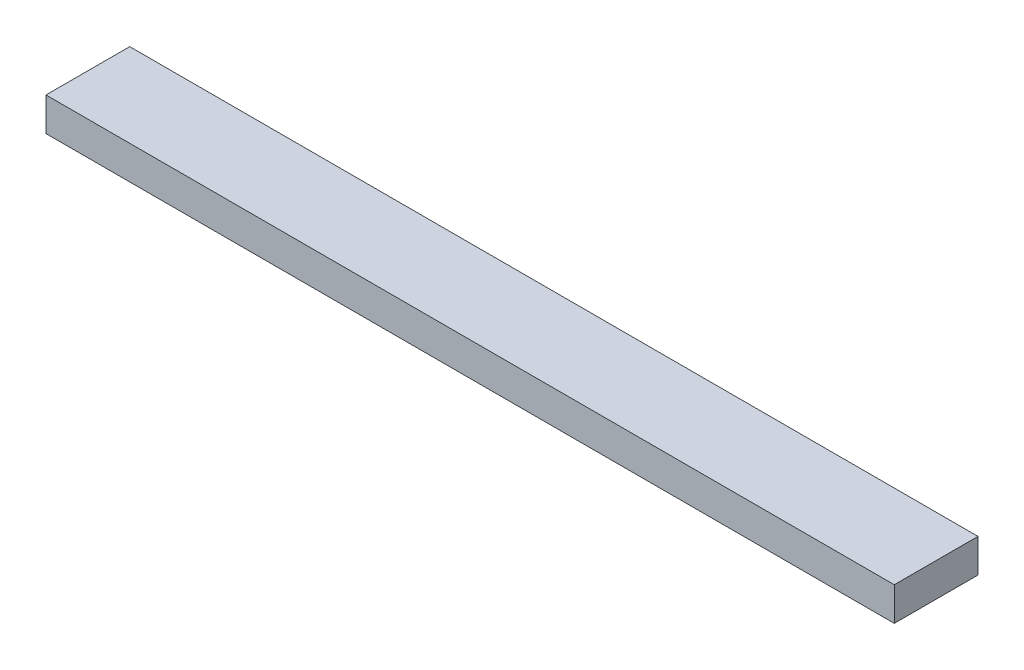
ISO-10303-21;
HEADER;
FILE_DESCRIPTION(('STEP AP214'),'2;1');
FILE_NAME('part.step','',(''),(''),'','','');
FILE_SCHEMA(('AUTOMOTIVE_DESIGN { 1 0 10303 214 1 1 1 1 }'));
ENDSEC;
DATA;
#1=APPLICATION_CONTEXT('core data for automotive mechanical design processes');
#2=APPLICATION_PROTOCOL_DEFINITION('international standard','automotive_design',2000,#1);
#3=PRODUCT_CONTEXT('',#1,'mechanical');
#4=PRODUCT('Part','Part','',(#3));
#5=PRODUCT_RELATED_PRODUCT_CATEGORY('part','',(#4));
#6=PRODUCT_DEFINITION_FORMATION('','',#4);
#7=PRODUCT_DEFINITION_CONTEXT('part definition',#1,'design');
#8=PRODUCT_DEFINITION('design','',#6,#7);
#9=PRODUCT_DEFINITION_SHAPE('','',#8);
#10=(LENGTH_UNIT() NAMED_UNIT(*) SI_UNIT(.MILLI.,.METRE.));
#11=(NAMED_UNIT(*) PLANE_ANGLE_UNIT() SI_UNIT($,.RADIAN.));
#12=(NAMED_UNIT(*) SI_UNIT($,.STERADIAN.) SOLID_ANGLE_UNIT());
#13=UNCERTAINTY_MEASURE_WITH_UNIT(LENGTH_MEASURE(1.E-05),#10,'distance_accuracy_value','');
#14=(GEOMETRIC_REPRESENTATION_CONTEXT(3) GLOBAL_UNCERTAINTY_ASSIGNED_CONTEXT((#13)) GLOBAL_UNIT_ASSIGNED_CONTEXT((#10,
#11,#12)) REPRESENTATION_CONTEXT('',''));
#15=CARTESIAN_POINT('',(0.,0.,0.));
#16=DIRECTION('',(0.,0.,1.));
#17=DIRECTION('',(1.,0.,0.));
#18=AXIS2_PLACEMENT_3D('',#15,#16,#17);
#19=CARTESIAN_POINT('',(-152.,26.0571428571429,30.));
#20=DIRECTION('',(1.,0.,0.));
#21=DIRECTION('',(0.,1.,0.));
#22=AXIS2_PLACEMENT_3D('',#19,#20,#21);
#23=PLANE('',#22);
#24=DIRECTION('',(0.,-1.,0.));
#25=VECTOR('',#24,1.);
#26=CARTESIAN_POINT('',(-152.,26.0571428571429,0.));
#27=LINE('',#26,#25);
#28=CARTESIAN_POINT('',(-152.,26.0571428571429,0.));
#29=VERTEX_POINT('',#28);
#30=CARTESIAN_POINT('',(-152.,14.0571428571429,0.));
#31=VERTEX_POINT('',#30);
#32=EDGE_CURVE('E98',#29,#31,#27,.T.);
#33=ORIENTED_EDGE('',*,*,#32,.T.);
#34=DIRECTION('',(0.,0.,-1.));
#35=VECTOR('',#34,1.);
#36=CARTESIAN_POINT('',(-152.,14.0571428571429,30.));
#37=LINE('',#36,#35);
#38=CARTESIAN_POINT('',(-152.,14.0571428571429,30.));
#39=VERTEX_POINT('',#38);
#40=EDGE_CURVE('E11',#39,#31,#37,.T.);
#41=ORIENTED_EDGE('',*,*,#40,.F.);
#42=DIRECTION('',(0.,-1.,0.));
#43=VECTOR('',#42,1.);
#44=CARTESIAN_POINT('',(-152.,26.0571428571429,30.));
#45=LINE('',#44,#43);
#46=CARTESIAN_POINT('',(-152.,26.0571428571429,30.));
#47=VERTEX_POINT('',#46);
#48=EDGE_CURVE('E86',#47,#39,#45,.T.);
#49=ORIENTED_EDGE('',*,*,#48,.F.);
#50=DIRECTION('',(0.,0.,-1.));
#51=VECTOR('',#50,1.);
#52=CARTESIAN_POINT('',(-152.,26.0571428571429,30.));
#53=LINE('',#52,#51);
#54=EDGE_CURVE('E94',#47,#29,#53,.T.);
#55=ORIENTED_EDGE('',*,*,#54,.T.);
#56=EDGE_LOOP('',(#33,#41,#49,#55));
#57=FACE_BOUND('',#56,.T.);
#58=ADVANCED_FACE('F35',(#57),#23,.F.);
#59=CARTESIAN_POINT('',(-152.,14.0571428571429,30.));
#60=DIRECTION('',(0.,1.,0.));
#61=DIRECTION('',(0.,0.,1.));
#62=AXIS2_PLACEMENT_3D('',#59,#60,#61);
#63=PLANE('',#62);
#64=DIRECTION('',(1.,0.,0.));
#65=VECTOR('',#64,1.);
#66=CARTESIAN_POINT('',(-152.,14.0571428571429,0.));
#67=LINE('',#66,#65);
#68=CARTESIAN_POINT('',(152.,14.0571428571429,0.));
#69=VERTEX_POINT('',#68);
#70=EDGE_CURVE('E90',#31,#69,#67,.T.);
#71=ORIENTED_EDGE('',*,*,#70,.T.);
#72=DIRECTION('',(0.,0.,-1.));
#73=VECTOR('',#72,1.);
#74=CARTESIAN_POINT('',(152.,14.0571428571429,30.));
#75=LINE('',#74,#73);
#76=CARTESIAN_POINT('',(152.,14.0571428571429,30.));
#77=VERTEX_POINT('',#76);
#78=EDGE_CURVE('E43',#77,#69,#75,.T.);
#79=ORIENTED_EDGE('',*,*,#78,.F.);
#80=DIRECTION('',(1.,0.,0.));
#81=VECTOR('',#80,1.);
#82=CARTESIAN_POINT('',(-152.,14.0571428571429,30.));
#83=LINE('',#82,#81);
#84=EDGE_CURVE('E81',#39,#77,#83,.T.);
#85=ORIENTED_EDGE('',*,*,#84,.F.);
#86=ORIENTED_EDGE('',*,*,#40,.T.);
#87=EDGE_LOOP('',(#71,#79,#85,#86));
#88=FACE_BOUND('',#87,.T.);
#89=ADVANCED_FACE('F89',(#88),#63,.F.);
#90=CARTESIAN_POINT('',(152.,26.0571428571429,30.));
#91=DIRECTION('',(-1.,0.,0.));
#92=DIRECTION('',(0.,0.,1.));
#93=AXIS2_PLACEMENT_3D('',#90,#91,#92);
#94=PLANE('',#93);
#95=DIRECTION('',(0.,1.,0.));
#96=VECTOR('',#95,1.);
#97=CARTESIAN_POINT('',(152.,26.0571428571429,0.));
#98=LINE('',#97,#96);
#99=CARTESIAN_POINT('',(152.,26.0571428571429,0.));
#100=VERTEX_POINT('',#99);
#101=EDGE_CURVE('E68',#69,#100,#98,.T.);
#102=ORIENTED_EDGE('',*,*,#101,.T.);
#103=DIRECTION('',(0.,0.,-1.));
#104=VECTOR('',#103,1.);
#105=CARTESIAN_POINT('',(152.,26.0571428571429,30.));
#106=LINE('',#105,#104);
#107=CARTESIAN_POINT('',(152.,26.0571428571429,30.));
#108=VERTEX_POINT('',#107);
#109=EDGE_CURVE('E91',#108,#100,#106,.T.);
#110=ORIENTED_EDGE('',*,*,#109,.F.);
#111=DIRECTION('',(0.,1.,0.));
#112=VECTOR('',#111,1.);
#113=CARTESIAN_POINT('',(152.,26.0571428571429,30.));
#114=LINE('',#113,#112);
#115=EDGE_CURVE('E84',#77,#108,#114,.T.);
#116=ORIENTED_EDGE('',*,*,#115,.F.);
#117=ORIENTED_EDGE('',*,*,#78,.T.);
#118=EDGE_LOOP('',(#102,#110,#116,#117));
#119=FACE_BOUND('',#118,.T.);
#120=ADVANCED_FACE('F92',(#119),#94,.F.);
#121=CARTESIAN_POINT('',(-152.,26.0571428571429,30.));
#122=DIRECTION('',(0.,-1.,0.));
#123=DIRECTION('',(0.,0.,-1.));
#124=AXIS2_PLACEMENT_3D('',#121,#122,#123);
#125=PLANE('',#124);
#126=DIRECTION('',(-1.,0.,0.));
#127=VECTOR('',#126,1.);
#128=CARTESIAN_POINT('',(-152.,26.0571428571429,0.));
#129=LINE('',#128,#127);
#130=EDGE_CURVE('E74',#100,#29,#129,.T.);
#131=ORIENTED_EDGE('',*,*,#130,.T.);
#132=ORIENTED_EDGE('',*,*,#54,.F.);
#133=DIRECTION('',(-1.,0.,0.));
#134=VECTOR('',#133,1.);
#135=CARTESIAN_POINT('',(-152.,26.0571428571429,30.));
#136=LINE('',#135,#134);
#137=EDGE_CURVE('E51',#108,#47,#136,.T.);
#138=ORIENTED_EDGE('',*,*,#137,.F.);
#139=ORIENTED_EDGE('',*,*,#109,.T.);
#140=EDGE_LOOP('',(#131,#132,#138,#139));
#141=FACE_BOUND('',#140,.T.);
#142=ADVANCED_FACE('F105',(#141),#125,.F.);
#143=CARTESIAN_POINT('',(0.,0.,30.));
#144=DIRECTION('',(0.,0.,1.));
#145=DIRECTION('',(1.,0.,0.));
#146=AXIS2_PLACEMENT_3D('',#143,#144,#145);
#147=PLANE('',#146);
#148=ORIENTED_EDGE('',*,*,#48,.T.);
#149=ORIENTED_EDGE('',*,*,#84,.T.);
#150=ORIENTED_EDGE('',*,*,#115,.T.);
#151=ORIENTED_EDGE('',*,*,#137,.T.);
#152=EDGE_LOOP('',(#148,#149,#150,#151));
#153=FACE_BOUND('',#152,.T.);
#154=ADVANCED_FACE('F82',(#153),#147,.T.);
#155=CARTESIAN_POINT('',(0.,0.,0.));
#156=DIRECTION('',(0.,0.,1.));
#157=DIRECTION('',(1.,0.,0.));
#158=AXIS2_PLACEMENT_3D('',#155,#156,#157);
#159=PLANE('',#158);
#160=ORIENTED_EDGE('',*,*,#32,.F.);
#161=ORIENTED_EDGE('',*,*,#130,.F.);
#162=ORIENTED_EDGE('',*,*,#101,.F.);
#163=ORIENTED_EDGE('',*,*,#70,.F.);
#164=EDGE_LOOP('',(#160,#161,#162,#163));
#165=FACE_BOUND('',#164,.T.);
#166=ADVANCED_FACE('F108',(#165),#159,.F.);
#167=CLOSED_SHELL('',(#58,#89,#120,#142,#154,#166));
#168=MANIFOLD_SOLID_BREP('B2',#167);
#169=ADVANCED_BREP_SHAPE_REPRESENTATION('',(#18,#168),#14);
#170=SHAPE_DEFINITION_REPRESENTATION(#9,#169);
ENDSEC;
END-ISO-10303-21;
